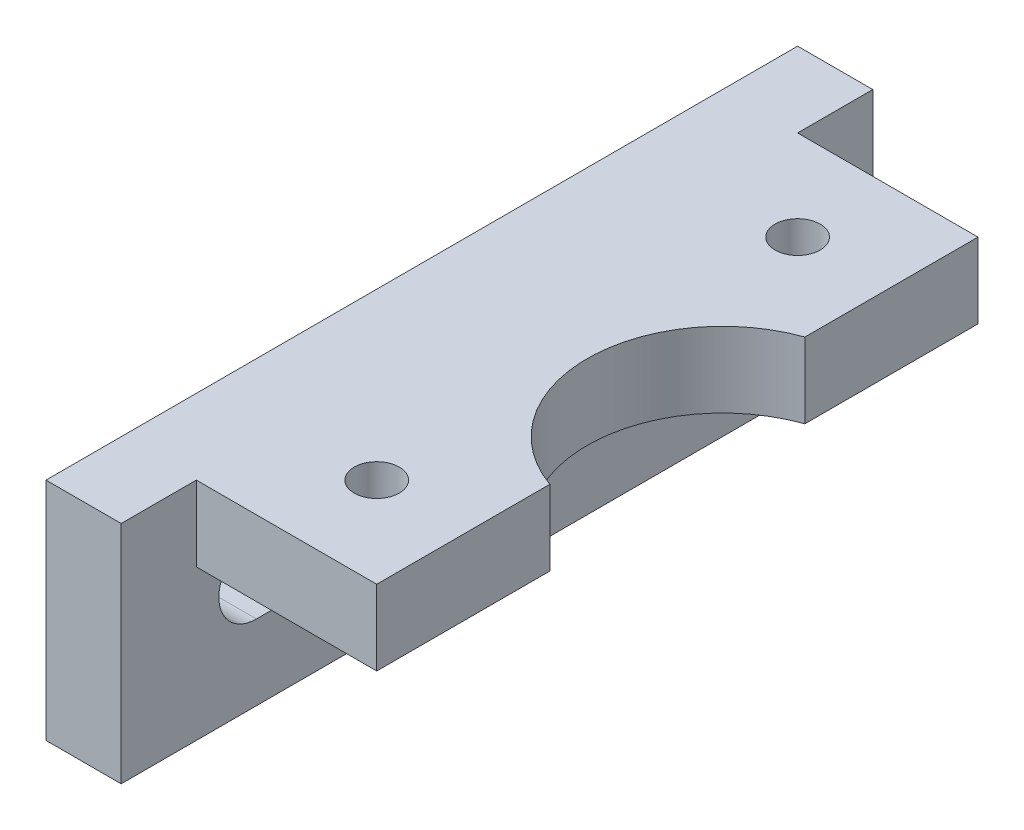
ISO-10303-21;
HEADER;
FILE_DESCRIPTION(('STEP AP214'),'2;1');
FILE_NAME('part.step','',(''),(''),'','','');
FILE_SCHEMA(('AUTOMOTIVE_DESIGN { 1 0 10303 214 1 1 1 1 }'));
ENDSEC;
DATA;
#1=APPLICATION_CONTEXT('core data for automotive mechanical design processes');
#2=APPLICATION_PROTOCOL_DEFINITION('international standard','automotive_design',2000,#1);
#3=PRODUCT_CONTEXT('',#1,'mechanical');
#4=PRODUCT('Part','Part','',(#3));
#5=PRODUCT_RELATED_PRODUCT_CATEGORY('part','',(#4));
#6=PRODUCT_DEFINITION_FORMATION('','',#4);
#7=PRODUCT_DEFINITION_CONTEXT('part definition',#1,'design');
#8=PRODUCT_DEFINITION('design','',#6,#7);
#9=PRODUCT_DEFINITION_SHAPE('','',#8);
#10=(LENGTH_UNIT() NAMED_UNIT(*) SI_UNIT(.MILLI.,.METRE.));
#11=(NAMED_UNIT(*) PLANE_ANGLE_UNIT() SI_UNIT($,.RADIAN.));
#12=(NAMED_UNIT(*) SI_UNIT($,.STERADIAN.) SOLID_ANGLE_UNIT());
#13=UNCERTAINTY_MEASURE_WITH_UNIT(LENGTH_MEASURE(1.E-05),#10,'distance_accuracy_value','');
#14=(GEOMETRIC_REPRESENTATION_CONTEXT(3) GLOBAL_UNCERTAINTY_ASSIGNED_CONTEXT((#13)) GLOBAL_UNIT_ASSIGNED_CONTEXT((#10,
#11,#12)) REPRESENTATION_CONTEXT('',''));
#15=CARTESIAN_POINT('',(0.,0.,0.));
#16=DIRECTION('',(0.,0.,1.));
#17=DIRECTION('',(1.,0.,0.));
#18=AXIS2_PLACEMENT_3D('',#15,#16,#17);
#19=CARTESIAN_POINT('',(12.,0.,0.));
#20=DIRECTION('',(1.,0.,0.));
#21=DIRECTION('',(0.,0.,-1.));
#22=AXIS2_PLACEMENT_3D('',#19,#20,#21);
#23=PLANE('',#22);
#24=DIRECTION('',(0.,1.,0.));
#25=VECTOR('',#24,1.);
#26=CARTESIAN_POINT('',(12.,-7.5,-8.48528137423857));
#27=LINE('',#26,#25);
#28=CARTESIAN_POINT('',(12.,2.5,-8.48528137423857));
#29=VERTEX_POINT('',#28);
#30=CARTESIAN_POINT('',(12.,7.5,-8.48528137423857));
#31=VERTEX_POINT('',#30);
#32=EDGE_CURVE('E11',#29,#31,#27,.T.);
#33=ORIENTED_EDGE('',*,*,#32,.F.);
#34=DIRECTION('',(0.,0.,-1.));
#35=VECTOR('',#34,1.);
#36=CARTESIAN_POINT('',(12.,2.5,20.));
#37=LINE('',#36,#35);
#38=CARTESIAN_POINT('',(12.,2.5,-20.));
#39=VERTEX_POINT('',#38);
#40=EDGE_CURVE('E250',#29,#39,#37,.T.);
#41=ORIENTED_EDGE('',*,*,#40,.T.);
#42=DIRECTION('',(0.,1.,0.));
#43=VECTOR('',#42,1.);
#44=CARTESIAN_POINT('',(12.,7.5,-20.));
#45=LINE('',#44,#43);
#46=CARTESIAN_POINT('',(12.,7.5,-20.));
#47=VERTEX_POINT('',#46);
#48=EDGE_CURVE('E150',#39,#47,#45,.T.);
#49=ORIENTED_EDGE('',*,*,#48,.T.);
#50=DIRECTION('',(0.,0.,1.));
#51=VECTOR('',#50,1.);
#52=CARTESIAN_POINT('',(12.,7.5,20.));
#53=LINE('',#52,#51);
#54=EDGE_CURVE('E145',#47,#31,#53,.T.);
#55=ORIENTED_EDGE('',*,*,#54,.T.);
#56=EDGE_LOOP('',(#33,#41,#49,#55));
#57=FACE_BOUND('',#56,.T.);
#58=ADVANCED_FACE('F33',(#57),#23,.T.);
#59=CARTESIAN_POINT('',(0.,0.,0.));
#60=DIRECTION('',(-1.,0.,0.));
#61=DIRECTION('',(0.,0.,1.));
#62=AXIS2_PLACEMENT_3D('',#59,#60,#61);
#63=PLANE('',#62);
#64=DIRECTION('',(0.,-1.,0.));
#65=VECTOR('',#64,1.);
#66=CARTESIAN_POINT('',(0.,7.5,20.));
#67=LINE('',#66,#65);
#68=CARTESIAN_POINT('',(0.,7.5,20.));
#69=VERTEX_POINT('',#68);
#70=CARTESIAN_POINT('',(0.,2.5,20.));
#71=VERTEX_POINT('',#70);
#72=EDGE_CURVE('E160',#69,#71,#67,.T.);
#73=ORIENTED_EDGE('',*,*,#72,.F.);
#74=DIRECTION('',(0.,0.,-1.));
#75=VECTOR('',#74,1.);
#76=CARTESIAN_POINT('',(0.,7.49999999999999,-25.));
#77=LINE('',#76,#75);
#78=CARTESIAN_POINT('',(0.,7.5,25.));
#79=VERTEX_POINT('',#78);
#80=EDGE_CURVE('E217',#79,#69,#77,.T.);
#81=ORIENTED_EDGE('',*,*,#80,.F.);
#82=DIRECTION('',(0.,1.,0.));
#83=VECTOR('',#82,1.);
#84=CARTESIAN_POINT('',(0.,7.5,25.));
#85=LINE('',#84,#83);
#86=CARTESIAN_POINT('',(0.,-7.5,25.));
#87=VERTEX_POINT('',#86);
#88=EDGE_CURVE('E202',#87,#79,#85,.T.);
#89=ORIENTED_EDGE('',*,*,#88,.F.);
#90=DIRECTION('',(0.,0.,1.));
#91=VECTOR('',#90,1.);
#92=CARTESIAN_POINT('',(0.,-7.5,-25.));
#93=LINE('',#92,#91);
#94=CARTESIAN_POINT('',(0.,-7.5,-25.));
#95=VERTEX_POINT('',#94);
#96=EDGE_CURVE('E207',#95,#87,#93,.T.);
#97=ORIENTED_EDGE('',*,*,#96,.F.);
#98=DIRECTION('',(0.,-1.,0.));
#99=VECTOR('',#98,1.);
#100=CARTESIAN_POINT('',(0.,7.49999999999999,-25.));
#101=LINE('',#100,#99);
#102=CARTESIAN_POINT('',(0.,7.49999999999999,-25.));
#103=VERTEX_POINT('',#102);
#104=EDGE_CURVE('E220',#103,#95,#101,.T.);
#105=ORIENTED_EDGE('',*,*,#104,.F.);
#106=CARTESIAN_POINT('',(0.,7.49999999999999,-20.));
#107=VERTEX_POINT('',#106);
#108=EDGE_CURVE('E216',#107,#103,#77,.T.);
#109=ORIENTED_EDGE('',*,*,#108,.F.);
#110=DIRECTION('',(0.,1.,0.));
#111=VECTOR('',#110,1.);
#112=CARTESIAN_POINT('',(0.,7.5,-20.));
#113=LINE('',#112,#111);
#114=CARTESIAN_POINT('',(0.,2.5,-20.));
#115=VERTEX_POINT('',#114);
#116=EDGE_CURVE('E164',#115,#107,#113,.T.);
#117=ORIENTED_EDGE('',*,*,#116,.F.);
#118=DIRECTION('',(0.,0.,-1.));
#119=VECTOR('',#118,1.);
#120=CARTESIAN_POINT('',(0.,2.5,20.));
#121=LINE('',#120,#119);
#122=CARTESIAN_POINT('',(0.,2.5,-16.));
#123=VERTEX_POINT('',#122);
#124=EDGE_CURVE('E165',#123,#115,#121,.T.);
#125=ORIENTED_EDGE('',*,*,#124,.F.);
#126=CARTESIAN_POINT('',(0.,0.,-16.));
#127=DIRECTION('',(-1.,0.,0.));
#128=DIRECTION('',(0.,0.,1.));
#129=AXIS2_PLACEMENT_3D('',#126,#127,#128);
#130=CIRCLE('',#129,2.5);
#131=CARTESIAN_POINT('',(0.,-2.5,-16.));
#132=VERTEX_POINT('',#131);
#133=EDGE_CURVE('E175',#123,#132,#130,.T.);
#134=ORIENTED_EDGE('',*,*,#133,.T.);
#135=DIRECTION('',(0.,0.,1.));
#136=VECTOR('',#135,1.);
#137=CARTESIAN_POINT('',(0.,-2.5,-16.));
#138=LINE('',#137,#136);
#139=CARTESIAN_POINT('',(0.,-2.5,16.));
#140=VERTEX_POINT('',#139);
#141=EDGE_CURVE('E189',#132,#140,#138,.T.);
#142=ORIENTED_EDGE('',*,*,#141,.T.);
#143=CARTESIAN_POINT('',(0.,0.,16.));
#144=DIRECTION('',(-1.,0.,0.));
#145=DIRECTION('',(0.,0.,1.));
#146=AXIS2_PLACEMENT_3D('',#143,#144,#145);
#147=CIRCLE('',#146,2.5);
#148=CARTESIAN_POINT('',(0.,2.5,16.));
#149=VERTEX_POINT('',#148);
#150=EDGE_CURVE('E179',#140,#149,#147,.T.);
#151=ORIENTED_EDGE('',*,*,#150,.T.);
#152=EDGE_CURVE('E57',#71,#149,#121,.T.);
#153=ORIENTED_EDGE('',*,*,#152,.F.);
#154=EDGE_LOOP('',(#73,#81,#89,#97,#105,#109,#117,#125,#134,#142,#151,#153));
#155=FACE_BOUND('',#154,.T.);
#156=ADVANCED_FACE('F267',(#155),#63,.F.);
#157=CARTESIAN_POINT('',(-5.,0.,0.));
#158=DIRECTION('',(-1.,0.,0.));
#159=DIRECTION('',(0.,0.,1.));
#160=AXIS2_PLACEMENT_3D('',#157,#158,#159);
#161=PLANE('',#160);
#162=DIRECTION('',(0.,1.,0.));
#163=VECTOR('',#162,1.);
#164=CARTESIAN_POINT('',(-5.,7.5,25.));
#165=LINE('',#164,#163);
#166=CARTESIAN_POINT('',(-5.,-7.5,25.));
#167=VERTEX_POINT('',#166);
#168=CARTESIAN_POINT('',(-5.,7.5,25.));
#169=VERTEX_POINT('',#168);
#170=EDGE_CURVE('E203',#167,#169,#165,.T.);
#171=ORIENTED_EDGE('',*,*,#170,.T.);
#172=DIRECTION('',(0.,0.,-1.));
#173=VECTOR('',#172,1.);
#174=CARTESIAN_POINT('',(-5.,7.49999999999999,-25.));
#175=LINE('',#174,#173);
#176=CARTESIAN_POINT('',(-5.,7.49999999999999,-25.));
#177=VERTEX_POINT('',#176);
#178=EDGE_CURVE('E206',#169,#177,#175,.T.);
#179=ORIENTED_EDGE('',*,*,#178,.T.);
#180=DIRECTION('',(0.,-1.,0.));
#181=VECTOR('',#180,1.);
#182=CARTESIAN_POINT('',(-5.,7.49999999999999,-25.));
#183=LINE('',#182,#181);
#184=CARTESIAN_POINT('',(-5.,-7.5,-25.));
#185=VERTEX_POINT('',#184);
#186=EDGE_CURVE('E209',#177,#185,#183,.T.);
#187=ORIENTED_EDGE('',*,*,#186,.T.);
#188=DIRECTION('',(0.,0.,1.));
#189=VECTOR('',#188,1.);
#190=CARTESIAN_POINT('',(-5.,-7.5,-25.));
#191=LINE('',#190,#189);
#192=EDGE_CURVE('E211',#185,#167,#191,.T.);
#193=ORIENTED_EDGE('',*,*,#192,.T.);
#194=EDGE_LOOP('',(#171,#179,#187,#193));
#195=FACE_BOUND('',#194,.T.);
#196=DIRECTION('',(0.,0.,1.));
#197=VECTOR('',#196,1.);
#198=CARTESIAN_POINT('',(-5.,-2.5,-16.));
#199=LINE('',#198,#197);
#200=CARTESIAN_POINT('',(-5.,-2.5,-16.));
#201=VERTEX_POINT('',#200);
#202=CARTESIAN_POINT('',(-5.,-2.5,16.));
#203=VERTEX_POINT('',#202);
#204=EDGE_CURVE('E178',#201,#203,#199,.T.);
#205=ORIENTED_EDGE('',*,*,#204,.F.);
#206=CARTESIAN_POINT('',(-5.,0.,-16.));
#207=DIRECTION('',(-1.,0.,0.));
#208=DIRECTION('',(0.,0.,1.));
#209=AXIS2_PLACEMENT_3D('',#206,#207,#208);
#210=CIRCLE('',#209,2.5);
#211=CARTESIAN_POINT('',(-5.,2.5,-16.));
#212=VERTEX_POINT('',#211);
#213=EDGE_CURVE('E176',#212,#201,#210,.T.);
#214=ORIENTED_EDGE('',*,*,#213,.F.);
#215=DIRECTION('',(0.,0.,-1.));
#216=VECTOR('',#215,1.);
#217=CARTESIAN_POINT('',(-5.,2.5,-16.));
#218=LINE('',#217,#216);
#219=CARTESIAN_POINT('',(-5.,2.5,16.));
#220=VERTEX_POINT('',#219);
#221=EDGE_CURVE('E184',#220,#212,#218,.T.);
#222=ORIENTED_EDGE('',*,*,#221,.F.);
#223=CARTESIAN_POINT('',(-5.,0.,16.));
#224=DIRECTION('',(-1.,0.,0.));
#225=DIRECTION('',(0.,0.,1.));
#226=AXIS2_PLACEMENT_3D('',#223,#224,#225);
#227=CIRCLE('',#226,2.5);
#228=EDGE_CURVE('E181',#203,#220,#227,.T.);
#229=ORIENTED_EDGE('',*,*,#228,.F.);
#230=EDGE_LOOP('',(#205,#214,#222,#229));
#231=FACE_BOUND('',#230,.T.);
#232=ADVANCED_FACE('F277',(#195,#231),#161,.T.);
#233=CARTESIAN_POINT('',(-5.,7.5,25.));
#234=DIRECTION('',(0.,0.,-1.));
#235=DIRECTION('',(0.,1.,0.));
#236=AXIS2_PLACEMENT_3D('',#233,#234,#235);
#237=PLANE('',#236);
#238=ORIENTED_EDGE('',*,*,#88,.T.);
#239=DIRECTION('',(1.,0.,0.));
#240=VECTOR('',#239,1.);
#241=CARTESIAN_POINT('',(-5.,7.5,25.));
#242=LINE('',#241,#240);
#243=EDGE_CURVE('E231',#169,#79,#242,.T.);
#244=ORIENTED_EDGE('',*,*,#243,.F.);
#245=ORIENTED_EDGE('',*,*,#170,.F.);
#246=DIRECTION('',(1.,0.,0.));
#247=VECTOR('',#246,1.);
#248=CARTESIAN_POINT('',(-5.,-7.5,25.));
#249=LINE('',#248,#247);
#250=EDGE_CURVE('E213',#167,#87,#249,.T.);
#251=ORIENTED_EDGE('',*,*,#250,.T.);
#252=EDGE_LOOP('',(#238,#244,#245,#251));
#253=FACE_BOUND('',#252,.T.);
#254=ADVANCED_FACE('F35',(#253),#237,.F.);
#255=CARTESIAN_POINT('',(-5.,7.49999999999999,-25.));
#256=DIRECTION('',(0.,-1.,0.));
#257=DIRECTION('',(0.,0.,-1.));
#258=AXIS2_PLACEMENT_3D('',#255,#256,#257);
#259=PLANE('',#258);
#260=CARTESIAN_POINT('',(6.,7.5,-14.));
#261=DIRECTION('',(0.,1.,0.));
#262=DIRECTION('',(0.,0.,1.));
#263=AXIS2_PLACEMENT_3D('',#260,#261,#262);
#264=CIRCLE('',#263,1.5);
#265=CARTESIAN_POINT('',(6.,7.5,-12.5));
#266=VERTEX_POINT('',#265);
#267=EDGE_CURVE('E236',#266,#266,#264,.T.);
#268=ORIENTED_EDGE('',*,*,#267,.F.);
#269=EDGE_LOOP('',(#268));
#270=FACE_BOUND('',#269,.T.);
#271=CARTESIAN_POINT('',(6.,7.5,14.));
#272=DIRECTION('',(0.,1.,0.));
#273=DIRECTION('',(0.,0.,1.));
#274=AXIS2_PLACEMENT_3D('',#271,#272,#273);
#275=CIRCLE('',#274,1.5);
#276=CARTESIAN_POINT('',(6.,7.5,15.5));
#277=VERTEX_POINT('',#276);
#278=EDGE_CURVE('E241',#277,#277,#275,.T.);
#279=ORIENTED_EDGE('',*,*,#278,.F.);
#280=EDGE_LOOP('',(#279));
#281=FACE_BOUND('',#280,.T.);
#282=CARTESIAN_POINT('',(12.,7.5,8.48528137423857));
#283=VERTEX_POINT('',#282);
#284=CARTESIAN_POINT('',(12.,7.5,20.));
#285=VERTEX_POINT('',#284);
#286=EDGE_CURVE('E147',#283,#285,#53,.T.);
#287=ORIENTED_EDGE('',*,*,#286,.F.);
#288=CARTESIAN_POINT('',(15.,7.5,0.));
#289=DIRECTION('',(0.,1.,0.));
#290=DIRECTION('',(0.,0.,1.));
#291=AXIS2_PLACEMENT_3D('',#288,#289,#290);
#292=CIRCLE('',#291,9.);
#293=EDGE_CURVE('E49',#31,#283,#292,.T.);
#294=ORIENTED_EDGE('',*,*,#293,.F.);
#295=ORIENTED_EDGE('',*,*,#54,.F.);
#296=DIRECTION('',(-1.,0.,0.));
#297=VECTOR('',#296,1.);
#298=CARTESIAN_POINT('',(12.,7.5,-20.));
#299=LINE('',#298,#297);
#300=EDGE_CURVE('E155',#47,#107,#299,.T.);
#301=ORIENTED_EDGE('',*,*,#300,.T.);
#302=ORIENTED_EDGE('',*,*,#108,.T.);
#303=DIRECTION('',(1.,0.,0.));
#304=VECTOR('',#303,1.);
#305=CARTESIAN_POINT('',(-5.,7.49999999999999,-25.));
#306=LINE('',#305,#304);
#307=EDGE_CURVE('E228',#177,#103,#306,.T.);
#308=ORIENTED_EDGE('',*,*,#307,.F.);
#309=ORIENTED_EDGE('',*,*,#178,.F.);
#310=ORIENTED_EDGE('',*,*,#243,.T.);
#311=ORIENTED_EDGE('',*,*,#80,.T.);
#312=DIRECTION('',(-1.,0.,0.));
#313=VECTOR('',#312,1.);
#314=CARTESIAN_POINT('',(12.,7.5,20.));
#315=LINE('',#314,#313);
#316=EDGE_CURVE('E152',#285,#69,#315,.T.);
#317=ORIENTED_EDGE('',*,*,#316,.F.);
#318=EDGE_LOOP('',(#287,#294,#295,#301,#302,#308,#309,#310,#311,#317));
#319=FACE_BOUND('',#318,.T.);
#320=ADVANCED_FACE('F143',(#270,#281,#319),#259,.F.);
#321=CARTESIAN_POINT('',(-5.,7.49999999999999,-25.));
#322=DIRECTION('',(0.,0.,1.));
#323=DIRECTION('',(0.,-1.,0.));
#324=AXIS2_PLACEMENT_3D('',#321,#322,#323);
#325=PLANE('',#324);
#326=ORIENTED_EDGE('',*,*,#104,.T.);
#327=DIRECTION('',(1.,0.,0.));
#328=VECTOR('',#327,1.);
#329=CARTESIAN_POINT('',(-5.,-7.5,-25.));
#330=LINE('',#329,#328);
#331=EDGE_CURVE('E225',#185,#95,#330,.T.);
#332=ORIENTED_EDGE('',*,*,#331,.F.);
#333=ORIENTED_EDGE('',*,*,#186,.F.);
#334=ORIENTED_EDGE('',*,*,#307,.T.);
#335=EDGE_LOOP('',(#326,#332,#333,#334));
#336=FACE_BOUND('',#335,.T.);
#337=ADVANCED_FACE('F264',(#336),#325,.F.);
#338=CARTESIAN_POINT('',(-5.,-7.5,-25.));
#339=DIRECTION('',(0.,1.,0.));
#340=DIRECTION('',(0.,0.,1.));
#341=AXIS2_PLACEMENT_3D('',#338,#339,#340);
#342=PLANE('',#341);
#343=ORIENTED_EDGE('',*,*,#96,.T.);
#344=ORIENTED_EDGE('',*,*,#250,.F.);
#345=ORIENTED_EDGE('',*,*,#192,.F.);
#346=ORIENTED_EDGE('',*,*,#331,.T.);
#347=EDGE_LOOP('',(#343,#344,#345,#346));
#348=FACE_BOUND('',#347,.T.);
#349=ADVANCED_FACE('F271',(#348),#342,.F.);
#350=CARTESIAN_POINT('',(-5.,0.,-16.));
#351=DIRECTION('',(1.,0.,0.));
#352=DIRECTION('',(0.,0.,-1.));
#353=AXIS2_PLACEMENT_3D('',#350,#351,#352);
#354=CYLINDRICAL_SURFACE('',#353,2.5);
#355=ORIENTED_EDGE('',*,*,#133,.F.);
#356=DIRECTION('',(1.,0.,0.));
#357=VECTOR('',#356,1.);
#358=CARTESIAN_POINT('',(-5.,2.5,-16.));
#359=LINE('',#358,#357);
#360=EDGE_CURVE('E186',#212,#123,#359,.T.);
#361=ORIENTED_EDGE('',*,*,#360,.F.);
#362=ORIENTED_EDGE('',*,*,#213,.T.);
#363=DIRECTION('',(1.,0.,0.));
#364=VECTOR('',#363,1.);
#365=CARTESIAN_POINT('',(-5.,-2.5,-16.));
#366=LINE('',#365,#364);
#367=EDGE_CURVE('E199',#201,#132,#366,.T.);
#368=ORIENTED_EDGE('',*,*,#367,.T.);
#369=EDGE_LOOP('',(#355,#361,#362,#368));
#370=FACE_BOUND('',#369,.T.);
#371=ADVANCED_FACE('F296',(#370),#354,.F.);
#372=CARTESIAN_POINT('',(-5.,-2.5,-16.));
#373=DIRECTION('',(0.,1.,0.));
#374=DIRECTION('',(0.,0.,1.));
#375=AXIS2_PLACEMENT_3D('',#372,#373,#374);
#376=PLANE('',#375);
#377=ORIENTED_EDGE('',*,*,#141,.F.);
#378=ORIENTED_EDGE('',*,*,#367,.F.);
#379=ORIENTED_EDGE('',*,*,#204,.T.);
#380=DIRECTION('',(1.,0.,0.));
#381=VECTOR('',#380,1.);
#382=CARTESIAN_POINT('',(-5.,-2.5,16.));
#383=LINE('',#382,#381);
#384=EDGE_CURVE('E197',#203,#140,#383,.T.);
#385=ORIENTED_EDGE('',*,*,#384,.T.);
#386=EDGE_LOOP('',(#377,#378,#379,#385));
#387=FACE_BOUND('',#386,.T.);
#388=ADVANCED_FACE('F298',(#387),#376,.T.);
#389=CARTESIAN_POINT('',(-5.,0.,16.));
#390=DIRECTION('',(1.,0.,0.));
#391=DIRECTION('',(0.,0.,-1.));
#392=AXIS2_PLACEMENT_3D('',#389,#390,#391);
#393=CYLINDRICAL_SURFACE('',#392,2.5);
#394=ORIENTED_EDGE('',*,*,#150,.F.);
#395=ORIENTED_EDGE('',*,*,#384,.F.);
#396=ORIENTED_EDGE('',*,*,#228,.T.);
#397=DIRECTION('',(1.,0.,0.));
#398=VECTOR('',#397,1.);
#399=CARTESIAN_POINT('',(-5.,2.5,16.));
#400=LINE('',#399,#398);
#401=EDGE_CURVE('E195',#220,#149,#400,.T.);
#402=ORIENTED_EDGE('',*,*,#401,.T.);
#403=EDGE_LOOP('',(#394,#395,#396,#402));
#404=FACE_BOUND('',#403,.T.);
#405=ADVANCED_FACE('F290',(#404),#393,.F.);
#406=CARTESIAN_POINT('',(-5.,2.5,-16.));
#407=DIRECTION('',(0.,-1.,0.));
#408=DIRECTION('',(0.,0.,-1.));
#409=AXIS2_PLACEMENT_3D('',#406,#407,#408);
#410=PLANE('',#409);
#411=CARTESIAN_POINT('',(6.,2.5,-14.));
#412=DIRECTION('',(0.,-1.,0.));
#413=DIRECTION('',(0.,0.,-1.));
#414=AXIS2_PLACEMENT_3D('',#411,#412,#413);
#415=CIRCLE('',#414,1.5);
#416=CARTESIAN_POINT('',(6.,2.5,-15.5));
#417=VERTEX_POINT('',#416);
#418=EDGE_CURVE('E37',#417,#417,#415,.T.);
#419=ORIENTED_EDGE('',*,*,#418,.F.);
#420=EDGE_LOOP('',(#419));
#421=FACE_BOUND('',#420,.T.);
#422=CARTESIAN_POINT('',(6.,2.5,14.));
#423=DIRECTION('',(0.,-1.,0.));
#424=DIRECTION('',(0.,0.,-1.));
#425=AXIS2_PLACEMENT_3D('',#422,#423,#424);
#426=CIRCLE('',#425,1.5);
#427=CARTESIAN_POINT('',(6.,2.5,12.5));
#428=VERTEX_POINT('',#427);
#429=EDGE_CURVE('E234',#428,#428,#426,.T.);
#430=ORIENTED_EDGE('',*,*,#429,.F.);
#431=EDGE_LOOP('',(#430));
#432=FACE_BOUND('',#431,.T.);
#433=CARTESIAN_POINT('',(15.,2.5,0.));
#434=DIRECTION('',(0.,-1.,0.));
#435=DIRECTION('',(0.,0.,-1.));
#436=AXIS2_PLACEMENT_3D('',#433,#434,#435);
#437=CIRCLE('',#436,9.);
#438=CARTESIAN_POINT('',(12.,2.5,8.48528137423857));
#439=VERTEX_POINT('',#438);
#440=EDGE_CURVE('E136',#439,#29,#437,.T.);
#441=ORIENTED_EDGE('',*,*,#440,.F.);
#442=CARTESIAN_POINT('',(12.,2.5,20.));
#443=VERTEX_POINT('',#442);
#444=EDGE_CURVE('E251',#443,#439,#37,.T.);
#445=ORIENTED_EDGE('',*,*,#444,.F.);
#446=DIRECTION('',(-1.,0.,0.));
#447=VECTOR('',#446,1.);
#448=CARTESIAN_POINT('',(12.,2.5,20.));
#449=LINE('',#448,#447);
#450=EDGE_CURVE('E173',#443,#71,#449,.T.);
#451=ORIENTED_EDGE('',*,*,#450,.T.);
#452=ORIENTED_EDGE('',*,*,#152,.T.);
#453=ORIENTED_EDGE('',*,*,#401,.F.);
#454=ORIENTED_EDGE('',*,*,#221,.T.);
#455=ORIENTED_EDGE('',*,*,#360,.T.);
#456=ORIENTED_EDGE('',*,*,#124,.T.);
#457=DIRECTION('',(-1.,0.,0.));
#458=VECTOR('',#457,1.);
#459=CARTESIAN_POINT('',(12.,2.5,-20.));
#460=LINE('',#459,#458);
#461=EDGE_CURVE('E170',#39,#115,#460,.T.);
#462=ORIENTED_EDGE('',*,*,#461,.F.);
#463=ORIENTED_EDGE('',*,*,#40,.F.);
#464=EDGE_LOOP('',(#441,#445,#451,#452,#453,#454,#455,#456,#462,#463));
#465=FACE_BOUND('',#464,.T.);
#466=ADVANCED_FACE('F257',(#421,#432,#465),#410,.T.);
#467=CARTESIAN_POINT('',(12.,7.5,20.));
#468=DIRECTION('',(0.,0.,-1.));
#469=DIRECTION('',(-1.,0.,0.));
#470=AXIS2_PLACEMENT_3D('',#467,#468,#469);
#471=PLANE('',#470);
#472=ORIENTED_EDGE('',*,*,#72,.T.);
#473=ORIENTED_EDGE('',*,*,#450,.F.);
#474=DIRECTION('',(0.,-1.,0.));
#475=VECTOR('',#474,1.);
#476=CARTESIAN_POINT('',(12.,7.5,20.));
#477=LINE('',#476,#475);
#478=EDGE_CURVE('E167',#285,#443,#477,.T.);
#479=ORIENTED_EDGE('',*,*,#478,.F.);
#480=ORIENTED_EDGE('',*,*,#316,.T.);
#481=EDGE_LOOP('',(#472,#473,#479,#480));
#482=FACE_BOUND('',#481,.T.);
#483=ADVANCED_FACE('F281',(#482),#471,.F.);
#484=CARTESIAN_POINT('',(12.,7.5,-20.));
#485=DIRECTION('',(0.,0.,1.));
#486=DIRECTION('',(1.,0.,0.));
#487=AXIS2_PLACEMENT_3D('',#484,#485,#486);
#488=PLANE('',#487);
#489=ORIENTED_EDGE('',*,*,#116,.T.);
#490=ORIENTED_EDGE('',*,*,#300,.F.);
#491=ORIENTED_EDGE('',*,*,#48,.F.);
#492=ORIENTED_EDGE('',*,*,#461,.T.);
#493=EDGE_LOOP('',(#489,#490,#491,#492));
#494=FACE_BOUND('',#493,.T.);
#495=ADVANCED_FACE('F259',(#494),#488,.F.);
#496=DIRECTION('',(0.,1.,0.));
#497=VECTOR('',#496,1.);
#498=CARTESIAN_POINT('',(12.,-7.5,8.48528137423857));
#499=LINE('',#498,#497);
#500=EDGE_CURVE('E42',#283,#439,#499,.F.);
#501=ORIENTED_EDGE('',*,*,#500,.F.);
#502=ORIENTED_EDGE('',*,*,#286,.T.);
#503=ORIENTED_EDGE('',*,*,#478,.T.);
#504=ORIENTED_EDGE('',*,*,#444,.T.);
#505=EDGE_LOOP('',(#501,#502,#503,#504));
#506=FACE_BOUND('',#505,.T.);
#507=ADVANCED_FACE('F283',(#506),#23,.T.);
#508=CARTESIAN_POINT('',(15.,-7.5,0.));
#509=DIRECTION('',(0.,1.,0.));
#510=DIRECTION('',(0.,0.,1.));
#511=AXIS2_PLACEMENT_3D('',#508,#509,#510);
#512=CYLINDRICAL_SURFACE('',#511,9.);
#513=ORIENTED_EDGE('',*,*,#32,.T.);
#514=ORIENTED_EDGE('',*,*,#293,.T.);
#515=ORIENTED_EDGE('',*,*,#500,.T.);
#516=ORIENTED_EDGE('',*,*,#440,.T.);
#517=EDGE_LOOP('',(#513,#514,#515,#516));
#518=FACE_BOUND('',#517,.T.);
#519=ADVANCED_FACE('F134',(#518),#512,.F.);
#520=CARTESIAN_POINT('',(6.,-7.5,14.));
#521=DIRECTION('',(0.,1.,0.));
#522=DIRECTION('',(0.,0.,1.));
#523=AXIS2_PLACEMENT_3D('',#520,#521,#522);
#524=CYLINDRICAL_SURFACE('',#523,1.5);
#525=ORIENTED_EDGE('',*,*,#429,.T.);
#526=EDGE_LOOP('',(#525));
#527=FACE_BOUND('',#526,.T.);
#528=ORIENTED_EDGE('',*,*,#278,.T.);
#529=EDGE_LOOP('',(#528));
#530=FACE_BOUND('',#529,.T.);
#531=ADVANCED_FACE('F320',(#527,#530),#524,.F.);
#532=CARTESIAN_POINT('',(6.,-7.5,-14.));
#533=DIRECTION('',(0.,1.,0.));
#534=DIRECTION('',(0.,0.,1.));
#535=AXIS2_PLACEMENT_3D('',#532,#533,#534);
#536=CYLINDRICAL_SURFACE('',#535,1.5);
#537=ORIENTED_EDGE('',*,*,#418,.T.);
#538=EDGE_LOOP('',(#537));
#539=FACE_BOUND('',#538,.T.);
#540=ORIENTED_EDGE('',*,*,#267,.T.);
#541=EDGE_LOOP('',(#540));
#542=FACE_BOUND('',#541,.T.);
#543=ADVANCED_FACE('F333',(#539,#542),#536,.F.);
#544=CLOSED_SHELL('',(#58,#156,#232,#254,#320,#337,#349,#371,#388,#405,#466,#483,#495,#507,#519,
#531,#543));
#545=MANIFOLD_SOLID_BREP('B2',#544);
#546=ADVANCED_BREP_SHAPE_REPRESENTATION('',(#18,#545),#14);
#547=SHAPE_DEFINITION_REPRESENTATION(#9,#546);
ENDSEC;
END-ISO-10303-21;
